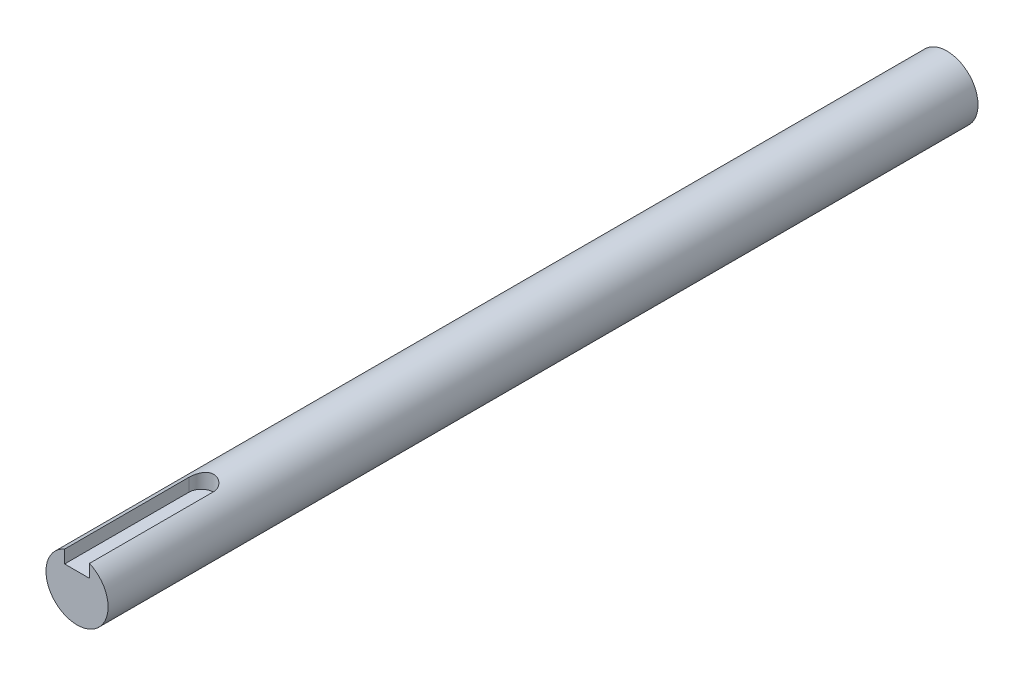
ISO-10303-21;
HEADER;
FILE_DESCRIPTION(('STEP AP214'),'2;1');
FILE_NAME('part.step','',(''),(''),'','','');
FILE_SCHEMA(('AUTOMOTIVE_DESIGN { 1 0 10303 214 1 1 1 1 }'));
ENDSEC;
DATA;
#1=APPLICATION_CONTEXT('core data for automotive mechanical design processes');
#2=APPLICATION_PROTOCOL_DEFINITION('international standard','automotive_design',2000,#1);
#3=PRODUCT_CONTEXT('',#1,'mechanical');
#4=PRODUCT('Part','Part','',(#3));
#5=PRODUCT_RELATED_PRODUCT_CATEGORY('part','',(#4));
#6=PRODUCT_DEFINITION_FORMATION('','',#4);
#7=PRODUCT_DEFINITION_CONTEXT('part definition',#1,'design');
#8=PRODUCT_DEFINITION('design','',#6,#7);
#9=PRODUCT_DEFINITION_SHAPE('','',#8);
#10=(LENGTH_UNIT() NAMED_UNIT(*) SI_UNIT(.MILLI.,.METRE.));
#11=(NAMED_UNIT(*) PLANE_ANGLE_UNIT() SI_UNIT($,.RADIAN.));
#12=(NAMED_UNIT(*) SI_UNIT($,.STERADIAN.) SOLID_ANGLE_UNIT());
#13=UNCERTAINTY_MEASURE_WITH_UNIT(LENGTH_MEASURE(1.E-05),#10,'distance_accuracy_value','');
#14=(GEOMETRIC_REPRESENTATION_CONTEXT(3) GLOBAL_UNCERTAINTY_ASSIGNED_CONTEXT((#13)) GLOBAL_UNIT_ASSIGNED_CONTEXT((#10,
#11,#12)) REPRESENTATION_CONTEXT('',''));
#15=CARTESIAN_POINT('',(0.,0.,0.));
#16=DIRECTION('',(0.,0.,1.));
#17=DIRECTION('',(1.,0.,0.));
#18=AXIS2_PLACEMENT_3D('',#15,#16,#17);
#19=CARTESIAN_POINT('',(0.,2.5,20.));
#20=DIRECTION('',(0.,1.,0.));
#21=DIRECTION('',(0.,0.,1.));
#22=AXIS2_PLACEMENT_3D('',#19,#20,#21);
#23=PLANE('',#22);
#24=DIRECTION('',(0.,0.,-1.));
#25=VECTOR('',#24,1.);
#26=CARTESIAN_POINT('',(2.,2.5,20.));
#27=LINE('',#26,#25);
#28=CARTESIAN_POINT('',(2.,2.5,20.));
#29=VERTEX_POINT('',#28);
#30=CARTESIAN_POINT('',(2.,2.5,0.));
#31=VERTEX_POINT('',#30);
#32=EDGE_CURVE('E51',#29,#31,#27,.T.);
#33=ORIENTED_EDGE('',*,*,#32,.T.);
#34=CARTESIAN_POINT('',(0.,2.5,0.));
#35=DIRECTION('',(0.,-1.,0.));
#36=DIRECTION('',(0.,0.,-1.));
#37=AXIS2_PLACEMENT_3D('',#34,#35,#36);
#38=CIRCLE('',#37,2.);
#39=CARTESIAN_POINT('',(-2.,2.5,0.));
#40=VERTEX_POINT('',#39);
#41=EDGE_CURVE('E82',#40,#31,#38,.T.);
#42=ORIENTED_EDGE('',*,*,#41,.F.);
#43=DIRECTION('',(0.,0.,-1.));
#44=VECTOR('',#43,1.);
#45=CARTESIAN_POINT('',(-2.,2.5,20.));
#46=LINE('',#45,#44);
#47=CARTESIAN_POINT('',(-2.,2.5,20.));
#48=VERTEX_POINT('',#47);
#49=EDGE_CURVE('E11',#48,#40,#46,.T.);
#50=ORIENTED_EDGE('',*,*,#49,.F.);
#51=DIRECTION('',(1.,0.,0.));
#52=VECTOR('',#51,1.);
#53=CARTESIAN_POINT('',(0.,2.5,20.));
#54=LINE('',#53,#52);
#55=EDGE_CURVE('E97',#48,#29,#54,.T.);
#56=ORIENTED_EDGE('',*,*,#55,.T.);
#57=EDGE_LOOP('',(#33,#42,#50,#56));
#58=FACE_BOUND('',#57,.T.);
#59=ADVANCED_FACE('F35',(#58),#23,.T.);
#60=CARTESIAN_POINT('',(-2.,0.,20.));
#61=DIRECTION('',(-1.,0.,0.));
#62=DIRECTION('',(0.,0.,1.));
#63=AXIS2_PLACEMENT_3D('',#60,#61,#62);
#64=PLANE('',#63);
#65=DIRECTION('',(0.,1.,0.));
#66=VECTOR('',#65,1.);
#67=CARTESIAN_POINT('',(-2.,0.,0.));
#68=LINE('',#67,#66);
#69=CARTESIAN_POINT('',(-2.,4.58257569495584,0.));
#70=VERTEX_POINT('',#69);
#71=EDGE_CURVE('E79',#40,#70,#68,.T.);
#72=ORIENTED_EDGE('',*,*,#71,.T.);
#73=DIRECTION('',(0.,0.,-1.));
#74=VECTOR('',#73,1.);
#75=CARTESIAN_POINT('',(-2.,4.58257569495584,20.));
#76=LINE('',#75,#74);
#77=CARTESIAN_POINT('',(-2.,4.58257569495584,20.));
#78=VERTEX_POINT('',#77);
#79=EDGE_CURVE('E43',#78,#70,#76,.T.);
#80=ORIENTED_EDGE('',*,*,#79,.F.);
#81=DIRECTION('',(0.,1.,0.));
#82=VECTOR('',#81,1.);
#83=CARTESIAN_POINT('',(-2.,0.,20.));
#84=LINE('',#83,#82);
#85=EDGE_CURVE('E95',#48,#78,#84,.T.);
#86=ORIENTED_EDGE('',*,*,#85,.F.);
#87=ORIENTED_EDGE('',*,*,#49,.T.);
#88=EDGE_LOOP('',(#72,#80,#86,#87));
#89=FACE_BOUND('',#88,.T.);
#90=ADVANCED_FACE('F94',(#89),#64,.F.);
#91=CARTESIAN_POINT('',(0.,0.,20.));
#92=DIRECTION('',(0.,0.,-1.));
#93=DIRECTION('',(-1.,0.,0.));
#94=AXIS2_PLACEMENT_3D('',#91,#92,#93);
#95=CYLINDRICAL_SURFACE('',#94,5.);
#96=ORIENTED_EDGE('',*,*,#79,.T.);
#97=CARTESIAN_POINT('',(0.,5.,-2.));
#98=CARTESIAN_POINT('',(0.107493005442891,4.99999271227085,-1.99999014817627));
#99=CARTESIAN_POINT('',(0.215172564090673,4.99649294306932,-1.99128224791162));
#100=CARTESIAN_POINT('',(0.427496480417896,4.98283453100641,-1.95675229647876));
#101=CARTESIAN_POINT('',(0.532131777561248,4.97265778698877,-1.93088372091387));
#102=CARTESIAN_POINT('',(0.734953922727403,4.94674209213118,-1.86312392194117));
#103=CARTESIAN_POINT('',(0.833160661616959,4.93102136364072,-1.82128515378327));
#104=CARTESIAN_POINT('',(1.02107197032837,4.89556610796078,-1.72298082667345));
#105=CARTESIAN_POINT('',(1.11077947675099,4.87583297458057,-1.66652034508107));
#106=CARTESIAN_POINT('',(1.28350100757039,4.83330886170419,-1.53776450143906));
#107=CARTESIAN_POINT('',(1.36606227255021,4.8104229692919,-1.46489334375974));
#108=CARTESIAN_POINT('',(1.51817500478472,4.76460576906194,-1.30659999652322));
#109=CARTESIAN_POINT('',(1.58772010713353,4.74167444453792,-1.22117170278826));
#110=CARTESIAN_POINT('',(1.71487456729288,4.69722791797136,-1.03557192975773));
#111=CARTESIAN_POINT('',(1.77181498119547,4.67582115964951,-0.934913513976802));
#112=CARTESIAN_POINT('',(1.86775471903715,4.63833647186793,-0.724463601579958));
#113=CARTESIAN_POINT('',(1.90676256428583,4.62225601244176,-0.614676472151639));
#114=CARTESIAN_POINT('',(1.96389882339587,4.59826357660818,-0.394287666407897));
#115=CARTESIAN_POINT('',(1.98289396580565,4.59001420355605,-0.283948764423787));
#116=CARTESIAN_POINT('',(2.00217296164003,4.58164004049144,-0.0613650016927322));
#117=CARTESIAN_POINT('',(2.00246601631322,4.58151125522768,0.0508788946250149));
#118=CARTESIAN_POINT('',(1.98498936750454,4.58910500279994,0.265756671458044));
#119=CARTESIAN_POINT('',(1.96847531430514,4.5962817503845,0.368515714409031));
#120=CARTESIAN_POINT('',(1.91994688029782,4.61676187607836,0.569659556006714));
#121=CARTESIAN_POINT('',(1.88792979480463,4.63006632321673,0.668043588110308));
#122=CARTESIAN_POINT('',(1.80869473255107,4.6615948508853,0.860017836196041));
#123=CARTESIAN_POINT('',(1.76117986231532,4.67991379280788,0.95346923905469));
#124=CARTESIAN_POINT('',(1.65250646073221,4.7193811638989,1.13141581636156));
#125=CARTESIAN_POINT('',(1.59134280510084,4.74053065456848,1.21590760940281));
#126=CARTESIAN_POINT('',(1.45155059945443,4.78526736742271,1.380409728802));
#127=CARTESIAN_POINT('',(1.37193746297063,4.80891664976152,1.45956872944602));
#128=CARTESIAN_POINT('',(1.20031442743019,4.85459824958282,1.60368447800204));
#129=CARTESIAN_POINT('',(1.10830206533443,4.87663024445325,1.66863839741029));
#130=CARTESIAN_POINT('',(0.912077652605843,4.91714681264548,1.78361744741583));
#131=CARTESIAN_POINT('',(0.807660491346477,4.93555270095415,1.83332228119705));
#132=CARTESIAN_POINT('',(0.591023765482882,4.96614828328759,1.91416786107806));
#133=CARTESIAN_POINT('',(0.478808196849674,4.97834113462382,1.94531803755741));
#134=CARTESIAN_POINT('',(0.256895887607821,4.99456139506911,1.9864482954197));
#135=CARTESIAN_POINT('',(0.147443293985535,4.99902945833514,1.99757245425356));
#136=CARTESIAN_POINT('',(-0.071845309807817,5.00068478510631,2.00171310052861));
#137=CARTESIAN_POINT('',(-0.181681213223923,4.99787393582291,1.99473428154751));
#138=CARTESIAN_POINT('',(-0.393432739121987,4.98557567063753,1.96370824744801));
#139=CARTESIAN_POINT('',(-0.495482491775474,4.97639391345523,1.94044201964902));
#140=CARTESIAN_POINT('',(-0.69413542806078,4.952594414055,1.87856429169019));
#141=CARTESIAN_POINT('',(-0.790737910224844,4.9379759735653,1.83995082033132));
#142=CARTESIAN_POINT('',(-0.979078785816702,4.90416594770812,1.74721506032005));
#143=CARTESIAN_POINT('',(-1.07057802275541,4.88484815979804,1.69265452795685));
#144=CARTESIAN_POINT('',(-1.24344359124656,4.84373364745525,1.57005967609436));
#145=CARTESIAN_POINT('',(-1.32480584076113,4.8219359311027,1.50201995707739));
#146=CARTESIAN_POINT('',(-1.48072304302882,4.77645117638112,1.34912998705037));
#147=CARTESIAN_POINT('',(-1.55447393380606,4.75273441425052,1.26346645849379));
#148=CARTESIAN_POINT('',(-1.68675119741371,4.70741672917132,1.08055991699063));
#149=CARTESIAN_POINT('',(-1.74527506133751,4.68581615526511,0.983314999660051));
#150=CARTESIAN_POINT('',(-1.84580750193163,4.64714299907709,0.778538305405894));
#151=CARTESIAN_POINT('',(-1.88765059453445,4.63011630884788,0.670916000787689));
#152=CARTESIAN_POINT('',(-1.9522962197053,4.60323673477932,0.449266348284844));
#153=CARTESIAN_POINT('',(-1.97511280526932,4.59337855695998,0.335243794187574));
#154=CARTESIAN_POINT('',(-1.9997156172784,4.58271759299926,0.112872098225457));
#155=CARTESIAN_POINT('',(-2.00289708230287,4.58131421008171,0.00470516040664956));
#156=CARTESIAN_POINT('',(-1.99180315927752,4.58614836033098,-0.210544857713293));
#157=CARTESIAN_POINT('',(-1.97752998791378,4.59238492324794,-0.317628073902584));
#158=CARTESIAN_POINT('',(-1.93307136615365,4.61126649079021,-0.523332189855042));
#159=CARTESIAN_POINT('',(-1.90353749357098,4.62364831827449,-0.622120274432999));
#160=CARTESIAN_POINT('',(-1.83000544849101,4.65324001232696,-0.813378629613482));
#161=CARTESIAN_POINT('',(-1.78600328139381,4.67045121206007,-0.905847146899826));
#162=CARTESIAN_POINT('',(-1.68187276275973,4.70898609604491,-1.08760961927078));
#163=CARTESIAN_POINT('',(-1.62096533515949,4.73048882313242,-1.17641867013048));
#164=CARTESIAN_POINT('',(-1.4858921192715,4.77463804372237,-1.34299331720376));
#165=CARTESIAN_POINT('',(-1.41172233481812,4.79728488048406,-1.42075557212832));
#166=CARTESIAN_POINT('',(-1.24650550627246,4.84293567087394,-1.56820285326361));
#167=CARTESIAN_POINT('',(-1.15467600114614,4.86586757962185,-1.63703730689807));
#168=CARTESIAN_POINT('',(-0.959900320285779,4.90800406713717,-1.75833704262164));
#169=CARTESIAN_POINT('',(-0.856949004547237,4.92720691092906,-1.81079471215253));
#170=CARTESIAN_POINT('',(-0.644738062495202,4.95939714815861,-1.89662221519029));
#171=CARTESIAN_POINT('',(-0.535631618219695,4.97249363055028,-1.93032932356034));
#172=CARTESIAN_POINT('',(-0.31287654628122,4.99144306209366,-1.97863912095427));
#173=CARTESIAN_POINT('',(-0.199243525858912,4.99731899495638,-1.9933024367439));
#174=CARTESIAN_POINT('',(-0.0569122978909293,4.99975899504136,-1.99939538097827));
#175=CARTESIAN_POINT('',(-0.0284626887407582,5.00000192969176,-2.00000260862919));
#176=CARTESIAN_POINT('',(0.,5.,-2.));
#177=B_SPLINE_CURVE_WITH_KNOTS('',3,(#97,#98,#99,#100,#101,#102,#103,#104,#105,#106,#107,#108,
#109,#110,#111,#112,#113,#114,#115,#116,#117,#118,#119,#120,#121,#122,#123,#124,#125,#126,#127,
#128,#129,#130,#131,#132,#133,#134,#135,#136,#137,#138,#139,#140,#141,#142,#143,#144,#145,#146,
#147,#148,#149,#150,#151,#152,#153,#154,#155,#156,#157,#158,#159,#160,#161,#162,#163,#164,#165,
#166,#167,#168,#169,#170,#171,#172,#173,#174,#175,#176),.UNSPECIFIED.,.T.,.F.,(4,2,2,2,2,2,2,2,
2,2,2,2,2,2,2,2,2,2,2,2,2,2,2,2,2,2,2,2,2,2,2,2,2,2,2,2,2,2,2,4),(0.,0.322402987893071,
0.645683636007934,0.967911457471581,1.29002753567984,1.62597381700397,1.96208394934411,
2.31315258819217,2.66405423118268,2.99904105308828,3.33386306340488,3.64538328401372,
3.95695787256047,4.27489126298816,4.59294421938183,4.93558349186557,5.27829092839733,
5.62776913162806,5.9770695611379,6.30569184528007,6.63422893570082,6.94800455564365,
7.26182048993796,7.58523513398262,7.90877959498969,8.25368474624414,8.59864669043748,
8.94695045140828,9.29499672645934,9.61799673392748,9.94095572563046,10.2511431854877,
10.5614163580516,10.8894546805669,11.2175920134839,11.5670042353384,11.9165786364053,
12.2596430101332,12.6016125240434,12.686980458968),.UNSPECIFIED.);
#178=CARTESIAN_POINT('',(2.,4.58257569495584,0.));
#179=VERTEX_POINT('',#178);
#180=EDGE_CURVE('E84',#70,#179,#177,.T.);
#181=ORIENTED_EDGE('',*,*,#180,.T.);
#182=DIRECTION('',(0.,0.,-1.));
#183=VECTOR('',#182,1.);
#184=CARTESIAN_POINT('',(2.,4.58257569495584,20.));
#185=LINE('',#184,#183);
#186=CARTESIAN_POINT('',(2.,4.58257569495584,20.));
#187=VERTEX_POINT('',#186);
#188=EDGE_CURVE('E112',#187,#179,#185,.T.);
#189=ORIENTED_EDGE('',*,*,#188,.F.);
#190=CARTESIAN_POINT('',(0.,0.,20.));
#191=DIRECTION('',(0.,0.,1.));
#192=DIRECTION('',(1.,0.,0.));
#193=AXIS2_PLACEMENT_3D('',#190,#191,#192);
#194=CIRCLE('',#193,5.);
#195=EDGE_CURVE('E59',#78,#187,#194,.T.);
#196=ORIENTED_EDGE('',*,*,#195,.F.);
#197=EDGE_LOOP('',(#96,#181,#189,#196));
#198=FACE_BOUND('',#197,.T.);
#199=CARTESIAN_POINT('',(0.,0.,-120.));
#200=DIRECTION('',(0.,0.,1.));
#201=DIRECTION('',(1.,0.,0.));
#202=AXIS2_PLACEMENT_3D('',#199,#200,#201);
#203=CIRCLE('',#202,5.);
#204=CARTESIAN_POINT('',(5.,0.,-120.));
#205=VERTEX_POINT('',#204);
#206=EDGE_CURVE('E89',#205,#205,#203,.T.);
#207=ORIENTED_EDGE('',*,*,#206,.T.);
#208=EDGE_LOOP('',(#207));
#209=FACE_BOUND('',#208,.T.);
#210=ADVANCED_FACE('F119',(#198,#209),#95,.T.);
#211=CARTESIAN_POINT('',(2.,0.,20.));
#212=DIRECTION('',(-1.,0.,0.));
#213=DIRECTION('',(0.,0.,1.));
#214=AXIS2_PLACEMENT_3D('',#211,#212,#213);
#215=PLANE('',#214);
#216=DIRECTION('',(0.,1.,0.));
#217=VECTOR('',#216,1.);
#218=CARTESIAN_POINT('',(2.,0.,0.));
#219=LINE('',#218,#217);
#220=EDGE_CURVE('E88',#31,#179,#219,.T.);
#221=ORIENTED_EDGE('',*,*,#220,.F.);
#222=ORIENTED_EDGE('',*,*,#32,.F.);
#223=DIRECTION('',(0.,1.,0.));
#224=VECTOR('',#223,1.);
#225=CARTESIAN_POINT('',(2.,0.,20.));
#226=LINE('',#225,#224);
#227=EDGE_CURVE('E100',#29,#187,#226,.T.);
#228=ORIENTED_EDGE('',*,*,#227,.T.);
#229=ORIENTED_EDGE('',*,*,#188,.T.);
#230=EDGE_LOOP('',(#221,#222,#228,#229));
#231=FACE_BOUND('',#230,.T.);
#232=ADVANCED_FACE('F117',(#231),#215,.T.);
#233=CARTESIAN_POINT('',(0.,0.,20.));
#234=DIRECTION('',(0.,0.,1.));
#235=DIRECTION('',(1.,0.,0.));
#236=AXIS2_PLACEMENT_3D('',#233,#234,#235);
#237=PLANE('',#236);
#238=ORIENTED_EDGE('',*,*,#55,.F.);
#239=ORIENTED_EDGE('',*,*,#85,.T.);
#240=ORIENTED_EDGE('',*,*,#195,.T.);
#241=ORIENTED_EDGE('',*,*,#227,.F.);
#242=EDGE_LOOP('',(#238,#239,#240,#241));
#243=FACE_BOUND('',#242,.T.);
#244=ADVANCED_FACE('F99',(#243),#237,.T.);
#245=CARTESIAN_POINT('',(0.,0.,-120.));
#246=DIRECTION('',(0.,0.,1.));
#247=DIRECTION('',(1.,0.,0.));
#248=AXIS2_PLACEMENT_3D('',#245,#246,#247);
#249=PLANE('',#248);
#250=ORIENTED_EDGE('',*,*,#206,.F.);
#251=EDGE_LOOP('',(#250));
#252=FACE_BOUND('',#251,.T.);
#253=ADVANCED_FACE('F133',(#252),#249,.F.);
#254=CARTESIAN_POINT('',(0.,0.,0.));
#255=DIRECTION('',(0.,-1.,0.));
#256=DIRECTION('',(0.,0.,-1.));
#257=AXIS2_PLACEMENT_3D('',#254,#255,#256);
#258=CYLINDRICAL_SURFACE('',#257,2.);
#259=ORIENTED_EDGE('',*,*,#71,.F.);
#260=ORIENTED_EDGE('',*,*,#41,.T.);
#261=ORIENTED_EDGE('',*,*,#220,.T.);
#262=ORIENTED_EDGE('',*,*,#180,.F.);
#263=EDGE_LOOP('',(#259,#260,#261,#262));
#264=FACE_BOUND('',#263,.T.);
#265=ADVANCED_FACE('F81',(#264),#258,.F.);
#266=CLOSED_SHELL('',(#59,#90,#210,#232,#244,#253,#265));
#267=MANIFOLD_SOLID_BREP('B2',#266);
#268=ADVANCED_BREP_SHAPE_REPRESENTATION('',(#18,#267),#14);
#269=SHAPE_DEFINITION_REPRESENTATION(#9,#268);
ENDSEC;
END-ISO-10303-21;
